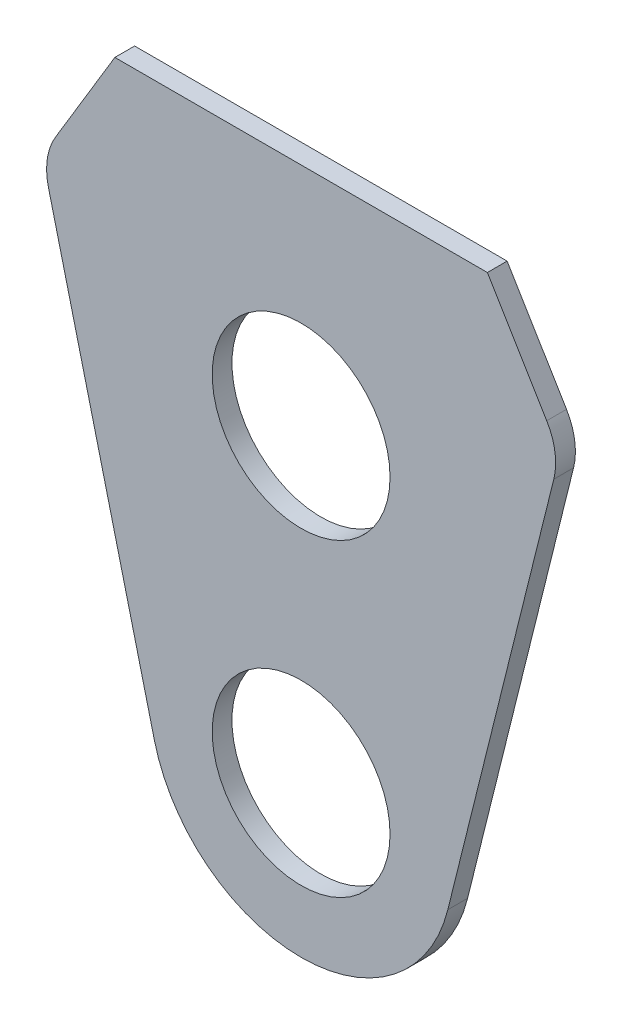
ISO-10303-21;
HEADER;
FILE_DESCRIPTION(('STEP AP214'),'2;1');
FILE_NAME('part.step','',(''),(''),'','','');
FILE_SCHEMA(('AUTOMOTIVE_DESIGN { 1 0 10303 214 1 1 1 1 }'));
ENDSEC;
DATA;
#1=APPLICATION_CONTEXT('core data for automotive mechanical design processes');
#2=APPLICATION_PROTOCOL_DEFINITION('international standard','automotive_design',2000,#1);
#3=PRODUCT_CONTEXT('',#1,'mechanical');
#4=PRODUCT('Part','Part','',(#3));
#5=PRODUCT_RELATED_PRODUCT_CATEGORY('part','',(#4));
#6=PRODUCT_DEFINITION_FORMATION('','',#4);
#7=PRODUCT_DEFINITION_CONTEXT('part definition',#1,'design');
#8=PRODUCT_DEFINITION('design','',#6,#7);
#9=PRODUCT_DEFINITION_SHAPE('','',#8);
#10=(LENGTH_UNIT() NAMED_UNIT(*) SI_UNIT(.MILLI.,.METRE.));
#11=(NAMED_UNIT(*) PLANE_ANGLE_UNIT() SI_UNIT($,.RADIAN.));
#12=(NAMED_UNIT(*) SI_UNIT($,.STERADIAN.) SOLID_ANGLE_UNIT());
#13=UNCERTAINTY_MEASURE_WITH_UNIT(LENGTH_MEASURE(1.E-05),#10,'distance_accuracy_value','');
#14=(GEOMETRIC_REPRESENTATION_CONTEXT(3) GLOBAL_UNCERTAINTY_ASSIGNED_CONTEXT((#13)) GLOBAL_UNIT_ASSIGNED_CONTEXT((#10,
#11,#12)) REPRESENTATION_CONTEXT('',''));
#15=CARTESIAN_POINT('',(0.,0.,0.));
#16=DIRECTION('',(0.,0.,1.));
#17=DIRECTION('',(1.,0.,0.));
#18=AXIS2_PLACEMENT_3D('',#15,#16,#17);
#19=CARTESIAN_POINT('',(-23.5684030120451,-5.86626249939616,3.175));
#20=DIRECTION('',(0.970392301062075,0.241534225399739,0.));
#21=DIRECTION('',(-0.241534225399739,0.970392301062075,0.));
#22=AXIS2_PLACEMENT_3D('',#19,#20,#21);
#23=PLANE('',#22);
#24=DIRECTION('',(0.241534225399739,-0.970392301062075,0.));
#25=VECTOR('',#24,1.);
#26=CARTESIAN_POINT('',(-23.5684030120451,-5.86626249939616,3.175));
#27=LINE('',#26,#25);
#28=CARTESIAN_POINT('',(-40.5956107930699,62.542557459535,3.175));
#29=VERTEX_POINT('',#28);
#30=CARTESIAN_POINT('',(-23.5684030120451,-5.86626249939617,3.175));
#31=VERTEX_POINT('',#30);
#32=EDGE_CURVE('E114',#29,#31,#27,.T.);
#33=ORIENTED_EDGE('',*,*,#32,.F.);
#34=DIRECTION('',(0.,0.,-1.));
#35=VECTOR('',#34,1.);
#36=CARTESIAN_POINT('',(-40.5956107930699,62.542557459535,0.));
#37=LINE('',#36,#35);
#38=CARTESIAN_POINT('',(-40.5956107930699,62.542557459535,0.));
#39=VERTEX_POINT('',#38);
#40=EDGE_CURVE('E170',#29,#39,#37,.T.);
#41=ORIENTED_EDGE('',*,*,#40,.T.);
#42=DIRECTION('',(0.241534225399739,-0.970392301062075,0.));
#43=VECTOR('',#42,1.);
#44=CARTESIAN_POINT('',(-23.5684030120451,-5.86626249939616,0.));
#45=LINE('',#44,#43);
#46=CARTESIAN_POINT('',(-23.5684030120451,-5.86626249939617,0.));
#47=VERTEX_POINT('',#46);
#48=EDGE_CURVE('E141',#39,#47,#45,.T.);
#49=ORIENTED_EDGE('',*,*,#48,.T.);
#50=DIRECTION('',(0.,0.,-1.));
#51=VECTOR('',#50,1.);
#52=CARTESIAN_POINT('',(-23.5684030120451,-5.86626249939617,3.175));
#53=LINE('',#52,#51);
#54=EDGE_CURVE('E134',#31,#47,#53,.T.);
#55=ORIENTED_EDGE('',*,*,#54,.F.);
#56=EDGE_LOOP('',(#33,#41,#49,#55));
#57=FACE_BOUND('',#56,.T.);
#58=ADVANCED_FACE('F50',(#57),#23,.F.);
#59=CARTESIAN_POINT('',(0.,0.,3.175));
#60=DIRECTION('',(0.,0.,-1.));
#61=DIRECTION('',(-1.,0.,0.));
#62=AXIS2_PLACEMENT_3D('',#59,#60,#61);
#63=CYLINDRICAL_SURFACE('',#62,24.2875);
#64=CARTESIAN_POINT('',(0.,0.,0.));
#65=DIRECTION('',(0.,0.,1.));
#66=DIRECTION('',(1.,0.,0.));
#67=AXIS2_PLACEMENT_3D('',#64,#65,#66);
#68=CIRCLE('',#67,24.2875);
#69=CARTESIAN_POINT('',(23.5684030120451,-5.86626249939617,0.));
#70=VERTEX_POINT('',#69);
#71=EDGE_CURVE('E207',#47,#70,#68,.T.);
#72=ORIENTED_EDGE('',*,*,#71,.T.);
#73=DIRECTION('',(0.,0.,-1.));
#74=VECTOR('',#73,1.);
#75=CARTESIAN_POINT('',(23.5684030120451,-5.86626249939617,3.175));
#76=LINE('',#75,#74);
#77=CARTESIAN_POINT('',(23.5684030120451,-5.86626249939617,3.175));
#78=VERTEX_POINT('',#77);
#79=EDGE_CURVE('E136',#78,#70,#76,.T.);
#80=ORIENTED_EDGE('',*,*,#79,.F.);
#81=CARTESIAN_POINT('',(0.,0.,3.175));
#82=DIRECTION('',(0.,0.,1.));
#83=DIRECTION('',(1.,0.,0.));
#84=AXIS2_PLACEMENT_3D('',#81,#82,#83);
#85=CIRCLE('',#84,24.2875);
#86=EDGE_CURVE('E119',#31,#78,#85,.T.);
#87=ORIENTED_EDGE('',*,*,#86,.F.);
#88=ORIENTED_EDGE('',*,*,#54,.T.);
#89=EDGE_LOOP('',(#72,#80,#87,#88));
#90=FACE_BOUND('',#89,.T.);
#91=ADVANCED_FACE('F133',(#90),#63,.T.);
#92=CARTESIAN_POINT('',(23.5684030120451,-5.86626249939617,3.175));
#93=DIRECTION('',(0.970392301062075,-0.241534225399739,0.));
#94=DIRECTION('',(0.241534225399739,0.970392301062075,0.));
#95=AXIS2_PLACEMENT_3D('',#92,#93,#94);
#96=PLANE('',#95);
#97=DIRECTION('',(-0.241534225399739,-0.970392301062075,0.));
#98=VECTOR('',#97,1.);
#99=CARTESIAN_POINT('',(23.5684030120451,-5.86626249939617,0.));
#100=LINE('',#99,#98);
#101=CARTESIAN_POINT('',(40.5956107930699,62.542557459535,0.));
#102=VERTEX_POINT('',#101);
#103=EDGE_CURVE('E189',#102,#70,#100,.T.);
#104=ORIENTED_EDGE('',*,*,#103,.F.);
#105=DIRECTION('',(0.,0.,-1.));
#106=VECTOR('',#105,1.);
#107=CARTESIAN_POINT('',(40.5956107930699,62.5425574595349,3.175));
#108=LINE('',#107,#106);
#109=CARTESIAN_POINT('',(40.5956107930699,62.542557459535,3.175));
#110=VERTEX_POINT('',#109);
#111=EDGE_CURVE('E59',#102,#110,#108,.F.);
#112=ORIENTED_EDGE('',*,*,#111,.T.);
#113=DIRECTION('',(-0.241534225399739,-0.970392301062075,0.));
#114=VECTOR('',#113,1.);
#115=CARTESIAN_POINT('',(23.5684030120451,-5.86626249939617,3.175));
#116=LINE('',#115,#114);
#117=EDGE_CURVE('E138',#110,#78,#116,.T.);
#118=ORIENTED_EDGE('',*,*,#117,.T.);
#119=ORIENTED_EDGE('',*,*,#79,.T.);
#120=EDGE_LOOP('',(#104,#112,#118,#119));
#121=FACE_BOUND('',#120,.T.);
#122=ADVANCED_FACE('F188',(#121),#96,.T.);
#123=CARTESIAN_POINT('',(0.,0.,3.175));
#124=DIRECTION('',(0.,0.,-1.));
#125=DIRECTION('',(-1.,0.,0.));
#126=AXIS2_PLACEMENT_3D('',#123,#124,#125);
#127=CYLINDRICAL_SURFACE('',#126,14.2875);
#128=CARTESIAN_POINT('',(0.,0.,3.175));
#129=DIRECTION('',(0.,0.,1.));
#130=DIRECTION('',(1.,0.,0.));
#131=AXIS2_PLACEMENT_3D('',#128,#129,#130);
#132=CIRCLE('',#131,14.2875);
#133=CARTESIAN_POINT('',(14.2875,0.,3.175));
#134=VERTEX_POINT('',#133);
#135=EDGE_CURVE('E196',#134,#134,#132,.T.);
#136=ORIENTED_EDGE('',*,*,#135,.T.);
#137=EDGE_LOOP('',(#136));
#138=FACE_BOUND('',#137,.T.);
#139=CARTESIAN_POINT('',(0.,0.,0.));
#140=DIRECTION('',(0.,0.,1.));
#141=DIRECTION('',(1.,0.,0.));
#142=AXIS2_PLACEMENT_3D('',#139,#140,#141);
#143=CIRCLE('',#142,14.2875);
#144=CARTESIAN_POINT('',(14.2875,0.,0.));
#145=VERTEX_POINT('',#144);
#146=EDGE_CURVE('E216',#145,#145,#143,.T.);
#147=ORIENTED_EDGE('',*,*,#146,.F.);
#148=EDGE_LOOP('',(#147));
#149=FACE_BOUND('',#148,.T.);
#150=ADVANCED_FACE('F235',(#138,#149),#127,.F.);
#151=CARTESIAN_POINT('',(0.,85.9699,3.175));
#152=DIRECTION('',(0.,1.,0.));
#153=DIRECTION('',(0.,0.,1.));
#154=AXIS2_PLACEMENT_3D('',#151,#152,#153);
#155=PLANE('',#154);
#156=DIRECTION('',(1.,0.,0.));
#157=VECTOR('',#156,1.);
#158=CARTESIAN_POINT('',(0.,85.9699,0.));
#159=LINE('',#158,#157);
#160=CARTESIAN_POINT('',(-29.9241122361792,85.9699,0.));
#161=VERTEX_POINT('',#160);
#162=CARTESIAN_POINT('',(29.9241122361793,85.9699,0.));
#163=VERTEX_POINT('',#162);
#164=EDGE_CURVE('E212',#161,#163,#159,.T.);
#165=ORIENTED_EDGE('',*,*,#164,.F.);
#166=DIRECTION('',(0.,0.,1.));
#167=VECTOR('',#166,1.);
#168=CARTESIAN_POINT('',(-29.9241122361792,85.9699,3.175));
#169=LINE('',#168,#167);
#170=CARTESIAN_POINT('',(-29.9241122361792,85.9699,3.175));
#171=VERTEX_POINT('',#170);
#172=EDGE_CURVE('E161',#161,#171,#169,.T.);
#173=ORIENTED_EDGE('',*,*,#172,.T.);
#174=DIRECTION('',(1.,0.,0.));
#175=VECTOR('',#174,1.);
#176=CARTESIAN_POINT('',(0.,85.9699,3.175));
#177=LINE('',#176,#175);
#178=CARTESIAN_POINT('',(29.9241122361793,85.9699,3.175));
#179=VERTEX_POINT('',#178);
#180=EDGE_CURVE('E192',#171,#179,#177,.T.);
#181=ORIENTED_EDGE('',*,*,#180,.T.);
#182=DIRECTION('',(0.,0.,-1.));
#183=VECTOR('',#182,1.);
#184=CARTESIAN_POINT('',(29.9241122361793,85.9699,3.175));
#185=LINE('',#184,#183);
#186=EDGE_CURVE('E157',#179,#163,#185,.T.);
#187=ORIENTED_EDGE('',*,*,#186,.T.);
#188=EDGE_LOOP('',(#165,#173,#181,#187));
#189=FACE_BOUND('',#188,.T.);
#190=ADVANCED_FACE('F227',(#189),#155,.T.);
#191=CARTESIAN_POINT('',(0.,49.6824,3.175));
#192=DIRECTION('',(0.,0.,-1.));
#193=DIRECTION('',(-1.,0.,0.));
#194=AXIS2_PLACEMENT_3D('',#191,#192,#193);
#195=CYLINDRICAL_SURFACE('',#194,14.2875);
#196=CARTESIAN_POINT('',(0.,49.6824,3.175));
#197=DIRECTION('',(0.,0.,1.));
#198=DIRECTION('',(1.,0.,0.));
#199=AXIS2_PLACEMENT_3D('',#196,#197,#198);
#200=CIRCLE('',#199,14.2875);
#201=CARTESIAN_POINT('',(14.2875,49.6824,3.175));
#202=VERTEX_POINT('',#201);
#203=EDGE_CURVE('E151',#202,#202,#200,.T.);
#204=ORIENTED_EDGE('',*,*,#203,.T.);
#205=EDGE_LOOP('',(#204));
#206=FACE_BOUND('',#205,.T.);
#207=CARTESIAN_POINT('',(0.,49.6824,0.));
#208=DIRECTION('',(0.,0.,1.));
#209=DIRECTION('',(1.,0.,0.));
#210=AXIS2_PLACEMENT_3D('',#207,#208,#209);
#211=CIRCLE('',#210,14.2875);
#212=CARTESIAN_POINT('',(14.2875,49.6824,0.));
#213=VERTEX_POINT('',#212);
#214=EDGE_CURVE('E128',#213,#213,#211,.T.);
#215=ORIENTED_EDGE('',*,*,#214,.F.);
#216=EDGE_LOOP('',(#215));
#217=FACE_BOUND('',#216,.T.);
#218=ADVANCED_FACE('F225',(#206,#217),#195,.F.);
#219=CARTESIAN_POINT('',(0.,0.,3.175));
#220=DIRECTION('',(0.,0.,1.));
#221=DIRECTION('',(1.,0.,0.));
#222=AXIS2_PLACEMENT_3D('',#219,#220,#221);
#223=PLANE('',#222);
#224=DIRECTION('',(-0.515380487823413,-0.856961465161008,0.));
#225=VECTOR('',#224,1.);
#226=CARTESIAN_POINT('',(-59.9453286449996,36.0513908452,3.175));
#227=LINE('',#226,#225);
#228=CARTESIAN_POINT('',(-39.4613024340592,70.1117045917665,3.175));
#229=VERTEX_POINT('',#228);
#230=EDGE_CURVE('E167',#171,#229,#227,.T.);
#231=ORIENTED_EDGE('',*,*,#230,.T.);
#232=CARTESIAN_POINT('',(-30.8916877824491,64.9578997135324,3.175));
#233=DIRECTION('',(0.,0.,1.));
#234=DIRECTION('',(1.,0.,0.));
#235=AXIS2_PLACEMENT_3D('',#232,#233,#234);
#236=CIRCLE('',#235,10.);
#237=EDGE_CURVE('E122',#229,#29,#236,.T.);
#238=ORIENTED_EDGE('',*,*,#237,.T.);
#239=ORIENTED_EDGE('',*,*,#32,.T.);
#240=ORIENTED_EDGE('',*,*,#86,.T.);
#241=ORIENTED_EDGE('',*,*,#117,.F.);
#242=CARTESIAN_POINT('',(30.8916877824491,64.9578997135324,3.175));
#243=DIRECTION('',(0.,0.,1.));
#244=DIRECTION('',(1.,0.,0.));
#245=AXIS2_PLACEMENT_3D('',#242,#243,#244);
#246=CIRCLE('',#245,10.);
#247=CARTESIAN_POINT('',(39.4613024340592,70.1117045917665,3.175));
#248=VERTEX_POINT('',#247);
#249=EDGE_CURVE('E66',#110,#248,#246,.T.);
#250=ORIENTED_EDGE('',*,*,#249,.T.);
#251=DIRECTION('',(0.515380487823413,-0.856961465161008,0.));
#252=VECTOR('',#251,1.);
#253=CARTESIAN_POINT('',(59.9453286449996,36.0513908452,3.175));
#254=LINE('',#253,#252);
#255=EDGE_CURVE('E164',#248,#179,#254,.F.);
#256=ORIENTED_EDGE('',*,*,#255,.T.);
#257=ORIENTED_EDGE('',*,*,#180,.F.);
#258=EDGE_LOOP('',(#231,#238,#239,#240,#241,#250,#256,#257));
#259=FACE_BOUND('',#258,.T.);
#260=ORIENTED_EDGE('',*,*,#135,.F.);
#261=EDGE_LOOP('',(#260));
#262=FACE_BOUND('',#261,.T.);
#263=ORIENTED_EDGE('',*,*,#203,.F.);
#264=EDGE_LOOP('',(#263));
#265=FACE_BOUND('',#264,.T.);
#266=ADVANCED_FACE('F117',(#259,#262,#265),#223,.T.);
#267=CARTESIAN_POINT('',(0.,0.,0.));
#268=DIRECTION('',(0.,0.,1.));
#269=DIRECTION('',(1.,0.,0.));
#270=AXIS2_PLACEMENT_3D('',#267,#268,#269);
#271=PLANE('',#270);
#272=ORIENTED_EDGE('',*,*,#48,.F.);
#273=CARTESIAN_POINT('',(-30.8916877824491,64.9578997135324,0.));
#274=DIRECTION('',(0.,0.,1.));
#275=DIRECTION('',(1.,0.,0.));
#276=AXIS2_PLACEMENT_3D('',#273,#274,#275);
#277=CIRCLE('',#276,10.);
#278=CARTESIAN_POINT('',(-39.4613024340592,70.1117045917665,0.));
#279=VERTEX_POINT('',#278);
#280=EDGE_CURVE('E176',#39,#279,#277,.F.);
#281=ORIENTED_EDGE('',*,*,#280,.T.);
#282=DIRECTION('',(0.515380487823413,0.856961465161008,0.));
#283=VECTOR('',#282,1.);
#284=CARTESIAN_POINT('',(-41.5960783124484,66.5620539787584,0.));
#285=LINE('',#284,#283);
#286=EDGE_CURVE('E149',#279,#161,#285,.T.);
#287=ORIENTED_EDGE('',*,*,#286,.T.);
#288=ORIENTED_EDGE('',*,*,#164,.T.);
#289=DIRECTION('',(-0.515380487823413,0.856961465161008,0.));
#290=VECTOR('',#289,1.);
#291=CARTESIAN_POINT('',(29.9241122361793,85.9699,0.));
#292=LINE('',#291,#290);
#293=CARTESIAN_POINT('',(39.4613024340592,70.1117045917665,0.));
#294=VERTEX_POINT('',#293);
#295=EDGE_CURVE('E144',#163,#294,#292,.F.);
#296=ORIENTED_EDGE('',*,*,#295,.T.);
#297=CARTESIAN_POINT('',(30.8916877824491,64.9578997135324,0.));
#298=DIRECTION('',(0.,0.,1.));
#299=DIRECTION('',(1.,0.,0.));
#300=AXIS2_PLACEMENT_3D('',#297,#298,#299);
#301=CIRCLE('',#300,10.);
#302=EDGE_CURVE('E173',#294,#102,#301,.F.);
#303=ORIENTED_EDGE('',*,*,#302,.T.);
#304=ORIENTED_EDGE('',*,*,#103,.T.);
#305=ORIENTED_EDGE('',*,*,#71,.F.);
#306=EDGE_LOOP('',(#272,#281,#287,#288,#296,#303,#304,#305));
#307=FACE_BOUND('',#306,.T.);
#308=ORIENTED_EDGE('',*,*,#146,.T.);
#309=EDGE_LOOP('',(#308));
#310=FACE_BOUND('',#309,.T.);
#311=ORIENTED_EDGE('',*,*,#214,.T.);
#312=EDGE_LOOP('',(#311));
#313=FACE_BOUND('',#312,.T.);
#314=ADVANCED_FACE('F223',(#307,#310,#313),#271,.F.);
#315=CARTESIAN_POINT('',(-41.5960783124484,66.5620539787584,3.175));
#316=DIRECTION('',(-0.856961465161007,0.515380487823413,0.));
#317=DIRECTION('',(0.,0.,1.));
#318=AXIS2_PLACEMENT_3D('',#315,#316,#317);
#319=PLANE('',#318);
#320=ORIENTED_EDGE('',*,*,#286,.F.);
#321=DIRECTION('',(0.,0.,-1.));
#322=VECTOR('',#321,1.);
#323=CARTESIAN_POINT('',(-39.4613024340592,70.1117045917665,3.175));
#324=LINE('',#323,#322);
#325=EDGE_CURVE('E179',#279,#229,#324,.F.);
#326=ORIENTED_EDGE('',*,*,#325,.T.);
#327=ORIENTED_EDGE('',*,*,#230,.F.);
#328=ORIENTED_EDGE('',*,*,#172,.F.);
#329=EDGE_LOOP('',(#320,#326,#327,#328));
#330=FACE_BOUND('',#329,.T.);
#331=ADVANCED_FACE('F248',(#330),#319,.T.);
#332=CARTESIAN_POINT('',(29.9241122361793,85.9699,3.175));
#333=DIRECTION('',(-0.856961465161008,-0.515380487823413,0.));
#334=DIRECTION('',(0.,0.,-1.));
#335=AXIS2_PLACEMENT_3D('',#332,#333,#334);
#336=PLANE('',#335);
#337=ORIENTED_EDGE('',*,*,#255,.F.);
#338=DIRECTION('',(0.,0.,1.));
#339=VECTOR('',#338,1.);
#340=CARTESIAN_POINT('',(39.4613024340592,70.1117045917665,3.175));
#341=LINE('',#340,#339);
#342=EDGE_CURVE('E12',#248,#294,#341,.F.);
#343=ORIENTED_EDGE('',*,*,#342,.T.);
#344=ORIENTED_EDGE('',*,*,#295,.F.);
#345=ORIENTED_EDGE('',*,*,#186,.F.);
#346=EDGE_LOOP('',(#337,#343,#344,#345));
#347=FACE_BOUND('',#346,.T.);
#348=ADVANCED_FACE('F251',(#347),#336,.F.);
#349=CARTESIAN_POINT('',(-30.8916877824491,64.9578997135324,3.175));
#350=DIRECTION('',(0.,0.,1.));
#351=DIRECTION('',(1.,0.,0.));
#352=AXIS2_PLACEMENT_3D('',#349,#350,#351);
#353=CYLINDRICAL_SURFACE('',#352,10.);
#354=ORIENTED_EDGE('',*,*,#237,.F.);
#355=ORIENTED_EDGE('',*,*,#325,.F.);
#356=ORIENTED_EDGE('',*,*,#280,.F.);
#357=ORIENTED_EDGE('',*,*,#40,.F.);
#358=EDGE_LOOP('',(#354,#355,#356,#357));
#359=FACE_BOUND('',#358,.T.);
#360=ADVANCED_FACE('F254',(#359),#353,.T.);
#361=CARTESIAN_POINT('',(30.8916877824491,64.9578997135324,3.175));
#362=DIRECTION('',(0.,0.,-1.));
#363=DIRECTION('',(-1.,0.,0.));
#364=AXIS2_PLACEMENT_3D('',#361,#362,#363);
#365=CYLINDRICAL_SURFACE('',#364,10.);
#366=ORIENTED_EDGE('',*,*,#302,.F.);
#367=ORIENTED_EDGE('',*,*,#342,.F.);
#368=ORIENTED_EDGE('',*,*,#249,.F.);
#369=ORIENTED_EDGE('',*,*,#111,.F.);
#370=EDGE_LOOP('',(#366,#367,#368,#369));
#371=FACE_BOUND('',#370,.T.);
#372=ADVANCED_FACE('F52',(#371),#365,.T.);
#373=CLOSED_SHELL('',(#58,#91,#122,#150,#190,#218,#266,#314,#331,#348,#360,#372));
#374=MANIFOLD_SOLID_BREP('B2',#373);
#375=ADVANCED_BREP_SHAPE_REPRESENTATION('',(#18,#374),#14);
#376=SHAPE_DEFINITION_REPRESENTATION(#9,#375);
ENDSEC;
END-ISO-10303-21;
